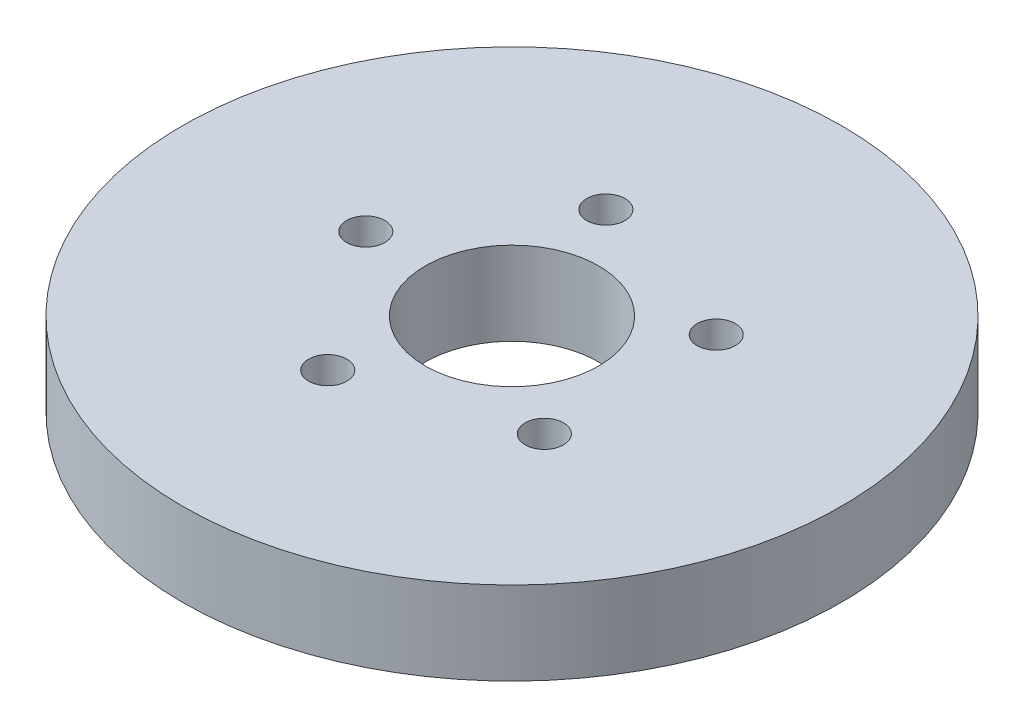
ISO-10303-21;
HEADER;
FILE_DESCRIPTION(('STEP AP214'),'2;1');
FILE_NAME('part.step','',(''),(''),'','','');
FILE_SCHEMA(('AUTOMOTIVE_DESIGN { 1 0 10303 214 1 1 1 1 }'));
ENDSEC;
DATA;
#1=APPLICATION_CONTEXT('core data for automotive mechanical design processes');
#2=APPLICATION_PROTOCOL_DEFINITION('international standard','automotive_design',2000,#1);
#3=PRODUCT_CONTEXT('',#1,'mechanical');
#4=PRODUCT('Part','Part','',(#3));
#5=PRODUCT_RELATED_PRODUCT_CATEGORY('part','',(#4));
#6=PRODUCT_DEFINITION_FORMATION('','',#4);
#7=PRODUCT_DEFINITION_CONTEXT('part definition',#1,'design');
#8=PRODUCT_DEFINITION('design','',#6,#7);
#9=PRODUCT_DEFINITION_SHAPE('','',#8);
#10=(LENGTH_UNIT() NAMED_UNIT(*) SI_UNIT(.MILLI.,.METRE.));
#11=(NAMED_UNIT(*) PLANE_ANGLE_UNIT() SI_UNIT($,.RADIAN.));
#12=(NAMED_UNIT(*) SI_UNIT($,.STERADIAN.) SOLID_ANGLE_UNIT());
#13=UNCERTAINTY_MEASURE_WITH_UNIT(LENGTH_MEASURE(1.E-05),#10,'distance_accuracy_value','');
#14=(GEOMETRIC_REPRESENTATION_CONTEXT(3) GLOBAL_UNCERTAINTY_ASSIGNED_CONTEXT((#13)) GLOBAL_UNIT_ASSIGNED_CONTEXT((#10,
#11,#12)) REPRESENTATION_CONTEXT('',''));
#15=CARTESIAN_POINT('',(0.,0.,0.));
#16=DIRECTION('',(0.,0.,1.));
#17=DIRECTION('',(1.,0.,0.));
#18=AXIS2_PLACEMENT_3D('',#15,#16,#17);
#19=CARTESIAN_POINT('',(0.,24.,0.));
#20=DIRECTION('',(0.,-1.,0.));
#21=DIRECTION('',(0.,0.,-1.));
#22=AXIS2_PLACEMENT_3D('',#19,#20,#21);
#23=CYLINDRICAL_SURFACE('',#22,95.);
#24=CARTESIAN_POINT('',(0.,24.,0.));
#25=DIRECTION('',(0.,1.,0.));
#26=DIRECTION('',(0.,0.,1.));
#27=AXIS2_PLACEMENT_3D('',#24,#25,#26);
#28=CIRCLE('',#27,95.);
#29=CARTESIAN_POINT('',(0.,24.,95.));
#30=VERTEX_POINT('',#29);
#31=EDGE_CURVE('E10',#30,#30,#28,.T.);
#32=ORIENTED_EDGE('',*,*,#31,.F.);
#33=EDGE_LOOP('',(#32));
#34=FACE_BOUND('',#33,.T.);
#35=CARTESIAN_POINT('',(0.,0.,0.));
#36=DIRECTION('',(0.,1.,0.));
#37=DIRECTION('',(0.,0.,1.));
#38=AXIS2_PLACEMENT_3D('',#35,#36,#37);
#39=CIRCLE('',#38,95.);
#40=CARTESIAN_POINT('',(0.,0.,95.));
#41=VERTEX_POINT('',#40);
#42=EDGE_CURVE('E37',#41,#41,#39,.T.);
#43=ORIENTED_EDGE('',*,*,#42,.T.);
#44=EDGE_LOOP('',(#43));
#45=FACE_BOUND('',#44,.T.);
#46=ADVANCED_FACE('F40',(#34,#45),#23,.T.);
#47=CARTESIAN_POINT('',(0.,24.,0.));
#48=DIRECTION('',(0.,1.,0.));
#49=DIRECTION('',(0.,0.,1.));
#50=AXIS2_PLACEMENT_3D('',#47,#48,#49);
#51=PLANE('',#50);
#52=CARTESIAN_POINT('',(-13.0248893471675,24.,40.0864875173072));
#53=DIRECTION('',(0.,1.,0.));
#54=DIRECTION('',(0.951056516295155,0.,0.309016994374945));
#55=AXIS2_PLACEMENT_3D('',#52,#53,#54);
#56=CIRCLE('',#55,5.5160585886308);
#57=CARTESIAN_POINT('',(-7.77880588218435,24.,41.791043363162));
#58=VERTEX_POINT('',#57);
#59=EDGE_CURVE('E78',#58,#58,#56,.T.);
#60=ORIENTED_EDGE('',*,*,#59,.F.);
#61=EDGE_LOOP('',(#60));
#62=FACE_BOUND('',#61,.T.);
#63=CARTESIAN_POINT('',(34.0996030105915,24.,24.774811775294));
#64=DIRECTION('',(0.,1.,0.));
#65=DIRECTION('',(0.587785252292469,0.,-0.809016994374951));
#66=AXIS2_PLACEMENT_3D('',#63,#64,#65);
#67=CIRCLE('',#66,5.5160585886308);
#68=CARTESIAN_POINT('',(37.3418608997699,24.,20.3122266351238));
#69=VERTEX_POINT('',#68);
#70=EDGE_CURVE('E71',#69,#69,#67,.T.);
#71=ORIENTED_EDGE('',*,*,#70,.F.);
#72=EDGE_LOOP('',(#71));
#73=FACE_BOUND('',#72,.T.);
#74=CARTESIAN_POINT('',(34.0996030105911,24.,-24.7748117752945));
#75=DIRECTION('',(0.,1.,0.));
#76=DIRECTION('',(-0.58778525229248,0.,-0.809016994374942));
#77=AXIS2_PLACEMENT_3D('',#74,#75,#76);
#78=CIRCLE('',#77,5.5160585886308);
#79=CARTESIAN_POINT('',(30.8573451214126,24.,-29.2373969154647));
#80=VERTEX_POINT('',#79);
#81=EDGE_CURVE('E70',#80,#80,#78,.T.);
#82=ORIENTED_EDGE('',*,*,#81,.F.);
#83=EDGE_LOOP('',(#82));
#84=FACE_BOUND('',#83,.T.);
#85=CARTESIAN_POINT('',(-13.0248893471681,24.,-40.086487517307));
#86=DIRECTION('',(0.,1.,0.));
#87=DIRECTION('',(-0.95105651629515,0.,0.309016994374958));
#88=AXIS2_PLACEMENT_3D('',#85,#86,#87);
#89=CIRCLE('',#88,5.5160585886308);
#90=CARTESIAN_POINT('',(-18.2709728121512,24.,-38.3819316714522));
#91=VERTEX_POINT('',#90);
#92=EDGE_CURVE('E61',#91,#91,#89,.T.);
#93=ORIENTED_EDGE('',*,*,#92,.F.);
#94=EDGE_LOOP('',(#93));
#95=FACE_BOUND('',#94,.T.);
#96=CARTESIAN_POINT('',(-42.1494273268473,24.,0.));
#97=DIRECTION('',(0.,1.,0.));
#98=DIRECTION('',(0.,0.,1.));
#99=AXIS2_PLACEMENT_3D('',#96,#97,#98);
#100=CIRCLE('',#99,5.5160585886308);
#101=CARTESIAN_POINT('',(-42.1494273268473,24.,5.5160585886308));
#102=VERTEX_POINT('',#101);
#103=EDGE_CURVE('E54',#102,#102,#100,.T.);
#104=ORIENTED_EDGE('',*,*,#103,.F.);
#105=EDGE_LOOP('',(#104));
#106=FACE_BOUND('',#105,.T.);
#107=CARTESIAN_POINT('',(0.,24.,0.));
#108=DIRECTION('',(0.,1.,0.));
#109=DIRECTION('',(0.,0.,1.));
#110=AXIS2_PLACEMENT_3D('',#107,#108,#109);
#111=CIRCLE('',#110,25.);
#112=CARTESIAN_POINT('',(0.,24.,25.));
#113=VERTEX_POINT('',#112);
#114=EDGE_CURVE('E50',#113,#113,#111,.T.);
#115=ORIENTED_EDGE('',*,*,#114,.F.);
#116=EDGE_LOOP('',(#115));
#117=FACE_BOUND('',#116,.T.);
#118=ORIENTED_EDGE('',*,*,#31,.T.);
#119=EDGE_LOOP('',(#118));
#120=FACE_BOUND('',#119,.T.);
#121=ADVANCED_FACE('F94',(#62,#73,#84,#95,#106,#117,#120),#51,.T.);
#122=CARTESIAN_POINT('',(0.,0.,0.));
#123=DIRECTION('',(0.,1.,0.));
#124=DIRECTION('',(0.,0.,1.));
#125=AXIS2_PLACEMENT_3D('',#122,#123,#124);
#126=PLANE('',#125);
#127=CARTESIAN_POINT('',(0.,0.,0.));
#128=DIRECTION('',(0.,1.,0.));
#129=DIRECTION('',(0.,0.,1.));
#130=AXIS2_PLACEMENT_3D('',#127,#128,#129);
#131=CIRCLE('',#130,25.);
#132=CARTESIAN_POINT('',(0.,0.,25.));
#133=VERTEX_POINT('',#132);
#134=EDGE_CURVE('E47',#133,#133,#131,.T.);
#135=ORIENTED_EDGE('',*,*,#134,.T.);
#136=EDGE_LOOP('',(#135));
#137=FACE_BOUND('',#136,.T.);
#138=ORIENTED_EDGE('',*,*,#42,.F.);
#139=EDGE_LOOP('',(#138));
#140=FACE_BOUND('',#139,.T.);
#141=ADVANCED_FACE('F100',(#137,#140),#126,.F.);
#142=CARTESIAN_POINT('',(0.,24.,0.));
#143=DIRECTION('',(0.,-1.,0.));
#144=DIRECTION('',(0.,0.,-1.));
#145=AXIS2_PLACEMENT_3D('',#142,#143,#144);
#146=CYLINDRICAL_SURFACE('',#145,25.);
#147=ORIENTED_EDGE('',*,*,#114,.T.);
#148=EDGE_LOOP('',(#147));
#149=FACE_BOUND('',#148,.T.);
#150=ORIENTED_EDGE('',*,*,#134,.F.);
#151=EDGE_LOOP('',(#150));
#152=FACE_BOUND('',#151,.T.);
#153=ADVANCED_FACE('F108',(#149,#152),#146,.F.);
#154=CARTESIAN_POINT('',(-42.1494273268473,5.56496897181216,0.));
#155=DIRECTION('',(0.,1.,0.));
#156=DIRECTION('',(0.,0.,1.));
#157=AXIS2_PLACEMENT_3D('',#154,#155,#156);
#158=CYLINDRICAL_SURFACE('',#157,5.5160585886308);
#159=CARTESIAN_POINT('',(-42.1494273268473,5.56496897181216,0.));
#160=DIRECTION('',(0.,1.,0.));
#161=DIRECTION('',(0.,0.,1.));
#162=AXIS2_PLACEMENT_3D('',#159,#160,#161);
#163=CIRCLE('',#162,5.5160585886308);
#164=CARTESIAN_POINT('',(-42.1494273268473,5.56496897181216,5.5160585886308));
#165=VERTEX_POINT('',#164);
#166=EDGE_CURVE('E55',#165,#165,#163,.T.);
#167=ORIENTED_EDGE('',*,*,#166,.F.);
#168=EDGE_LOOP('',(#167));
#169=FACE_BOUND('',#168,.T.);
#170=ORIENTED_EDGE('',*,*,#103,.T.);
#171=EDGE_LOOP('',(#170));
#172=FACE_BOUND('',#171,.T.);
#173=ADVANCED_FACE('F115',(#169,#172),#158,.F.);
#174=CARTESIAN_POINT('',(-42.1494273268473,5.56496897181216,0.));
#175=DIRECTION('',(0.,1.,0.));
#176=DIRECTION('',(0.,0.,1.));
#177=AXIS2_PLACEMENT_3D('',#174,#175,#176);
#178=PLANE('',#177);
#179=ORIENTED_EDGE('',*,*,#166,.T.);
#180=EDGE_LOOP('',(#179));
#181=FACE_BOUND('',#180,.T.);
#182=ADVANCED_FACE('F142',(#181),#178,.T.);
#183=CARTESIAN_POINT('',(-13.0248893471681,5.56496897181216,-40.086487517307));
#184=DIRECTION('',(0.,1.,0.));
#185=DIRECTION('',(0.,0.,1.));
#186=AXIS2_PLACEMENT_3D('',#183,#184,#185);
#187=CYLINDRICAL_SURFACE('',#186,5.5160585886308);
#188=CARTESIAN_POINT('',(-13.0248893471681,5.56496897181216,-40.086487517307));
#189=DIRECTION('',(0.,1.,0.));
#190=DIRECTION('',(-0.95105651629515,0.,0.309016994374958));
#191=AXIS2_PLACEMENT_3D('',#188,#189,#190);
#192=CIRCLE('',#191,5.5160585886308);
#193=CARTESIAN_POINT('',(-18.2709728121512,5.56496897181216,-38.3819316714522));
#194=VERTEX_POINT('',#193);
#195=EDGE_CURVE('E63',#194,#194,#192,.T.);
#196=ORIENTED_EDGE('',*,*,#195,.F.);
#197=EDGE_LOOP('',(#196));
#198=FACE_BOUND('',#197,.T.);
#199=ORIENTED_EDGE('',*,*,#92,.T.);
#200=EDGE_LOOP('',(#199));
#201=FACE_BOUND('',#200,.T.);
#202=ADVANCED_FACE('F147',(#198,#201),#187,.F.);
#203=CARTESIAN_POINT('',(-13.0248893471681,5.56496897181216,-40.086487517307));
#204=DIRECTION('',(0.,1.,0.));
#205=DIRECTION('',(-0.95105651629515,0.,0.309016994374958));
#206=AXIS2_PLACEMENT_3D('',#203,#204,#205);
#207=PLANE('',#206);
#208=ORIENTED_EDGE('',*,*,#195,.T.);
#209=EDGE_LOOP('',(#208));
#210=FACE_BOUND('',#209,.T.);
#211=ADVANCED_FACE('F163',(#210),#207,.T.);
#212=CARTESIAN_POINT('',(34.0996030105911,5.56496897181216,-24.7748117752945));
#213=DIRECTION('',(0.,1.,0.));
#214=DIRECTION('',(0.,0.,1.));
#215=AXIS2_PLACEMENT_3D('',#212,#213,#214);
#216=CYLINDRICAL_SURFACE('',#215,5.5160585886308);
#217=CARTESIAN_POINT('',(34.0996030105911,5.56496897181216,-24.7748117752945));
#218=DIRECTION('',(0.,1.,0.));
#219=DIRECTION('',(-0.58778525229248,0.,-0.809016994374942));
#220=AXIS2_PLACEMENT_3D('',#217,#218,#219);
#221=CIRCLE('',#220,5.5160585886308);
#222=CARTESIAN_POINT('',(30.8573451214126,5.56496897181216,-29.2373969154647));
#223=VERTEX_POINT('',#222);
#224=EDGE_CURVE('E69',#223,#223,#221,.T.);
#225=ORIENTED_EDGE('',*,*,#224,.F.);
#226=EDGE_LOOP('',(#225));
#227=FACE_BOUND('',#226,.T.);
#228=ORIENTED_EDGE('',*,*,#81,.T.);
#229=EDGE_LOOP('',(#228));
#230=FACE_BOUND('',#229,.T.);
#231=ADVANCED_FACE('F172',(#227,#230),#216,.F.);
#232=CARTESIAN_POINT('',(34.0996030105911,5.56496897181216,-24.7748117752945));
#233=DIRECTION('',(0.,1.,0.));
#234=DIRECTION('',(-0.58778525229248,0.,-0.809016994374942));
#235=AXIS2_PLACEMENT_3D('',#232,#233,#234);
#236=PLANE('',#235);
#237=ORIENTED_EDGE('',*,*,#224,.T.);
#238=EDGE_LOOP('',(#237));
#239=FACE_BOUND('',#238,.T.);
#240=ADVANCED_FACE('F185',(#239),#236,.T.);
#241=CARTESIAN_POINT('',(34.0996030105915,5.56496897181216,24.774811775294));
#242=DIRECTION('',(0.,1.,0.));
#243=DIRECTION('',(0.,0.,1.));
#244=AXIS2_PLACEMENT_3D('',#241,#242,#243);
#245=CYLINDRICAL_SURFACE('',#244,5.5160585886308);
#246=CARTESIAN_POINT('',(34.0996030105915,5.56496897181216,24.774811775294));
#247=DIRECTION('',(0.,1.,0.));
#248=DIRECTION('',(0.587785252292469,0.,-0.809016994374951));
#249=AXIS2_PLACEMENT_3D('',#246,#247,#248);
#250=CIRCLE('',#249,5.5160585886308);
#251=CARTESIAN_POINT('',(37.3418608997699,5.56496897181216,20.3122266351238));
#252=VERTEX_POINT('',#251);
#253=EDGE_CURVE('E76',#252,#252,#250,.T.);
#254=ORIENTED_EDGE('',*,*,#253,.F.);
#255=EDGE_LOOP('',(#254));
#256=FACE_BOUND('',#255,.T.);
#257=ORIENTED_EDGE('',*,*,#70,.T.);
#258=EDGE_LOOP('',(#257));
#259=FACE_BOUND('',#258,.T.);
#260=ADVANCED_FACE('F191',(#256,#259),#245,.F.);
#261=CARTESIAN_POINT('',(34.0996030105915,5.56496897181216,24.774811775294));
#262=DIRECTION('',(0.,1.,0.));
#263=DIRECTION('',(0.587785252292469,0.,-0.809016994374951));
#264=AXIS2_PLACEMENT_3D('',#261,#262,#263);
#265=PLANE('',#264);
#266=ORIENTED_EDGE('',*,*,#253,.T.);
#267=EDGE_LOOP('',(#266));
#268=FACE_BOUND('',#267,.T.);
#269=ADVANCED_FACE('F89',(#268),#265,.T.);
#270=CARTESIAN_POINT('',(-13.0248893471675,5.56496897181216,40.0864875173072));
#271=DIRECTION('',(0.,1.,0.));
#272=DIRECTION('',(0.,0.,1.));
#273=AXIS2_PLACEMENT_3D('',#270,#271,#272);
#274=CYLINDRICAL_SURFACE('',#273,5.5160585886308);
#275=CARTESIAN_POINT('',(-13.0248893471675,5.56496897181216,40.0864875173072));
#276=DIRECTION('',(0.,1.,0.));
#277=DIRECTION('',(0.951056516295155,0.,0.309016994374945));
#278=AXIS2_PLACEMENT_3D('',#275,#276,#277);
#279=CIRCLE('',#278,5.5160585886308);
#280=CARTESIAN_POINT('',(-7.77880588218435,5.56496897181216,41.791043363162));
#281=VERTEX_POINT('',#280);
#282=EDGE_CURVE('E59',#281,#281,#279,.T.);
#283=ORIENTED_EDGE('',*,*,#282,.F.);
#284=EDGE_LOOP('',(#283));
#285=FACE_BOUND('',#284,.T.);
#286=ORIENTED_EDGE('',*,*,#59,.T.);
#287=EDGE_LOOP('',(#286));
#288=FACE_BOUND('',#287,.T.);
#289=ADVANCED_FACE('F87',(#285,#288),#274,.F.);
#290=CARTESIAN_POINT('',(-13.0248893471675,5.56496897181216,40.0864875173072));
#291=DIRECTION('',(0.,1.,0.));
#292=DIRECTION('',(0.951056516295155,0.,0.309016994374945));
#293=AXIS2_PLACEMENT_3D('',#290,#291,#292);
#294=PLANE('',#293);
#295=ORIENTED_EDGE('',*,*,#282,.T.);
#296=EDGE_LOOP('',(#295));
#297=FACE_BOUND('',#296,.T.);
#298=ADVANCED_FACE('F84',(#297),#294,.T.);
#299=CLOSED_SHELL('',(#46,#121,#141,#153,#173,#182,#202,#211,#231,#240,#260,#269,#289,#298));
#300=MANIFOLD_SOLID_BREP('B2',#299);
#301=ADVANCED_BREP_SHAPE_REPRESENTATION('',(#18,#300),#14);
#302=SHAPE_DEFINITION_REPRESENTATION(#9,#301);
ENDSEC;
END-ISO-10303-21;
